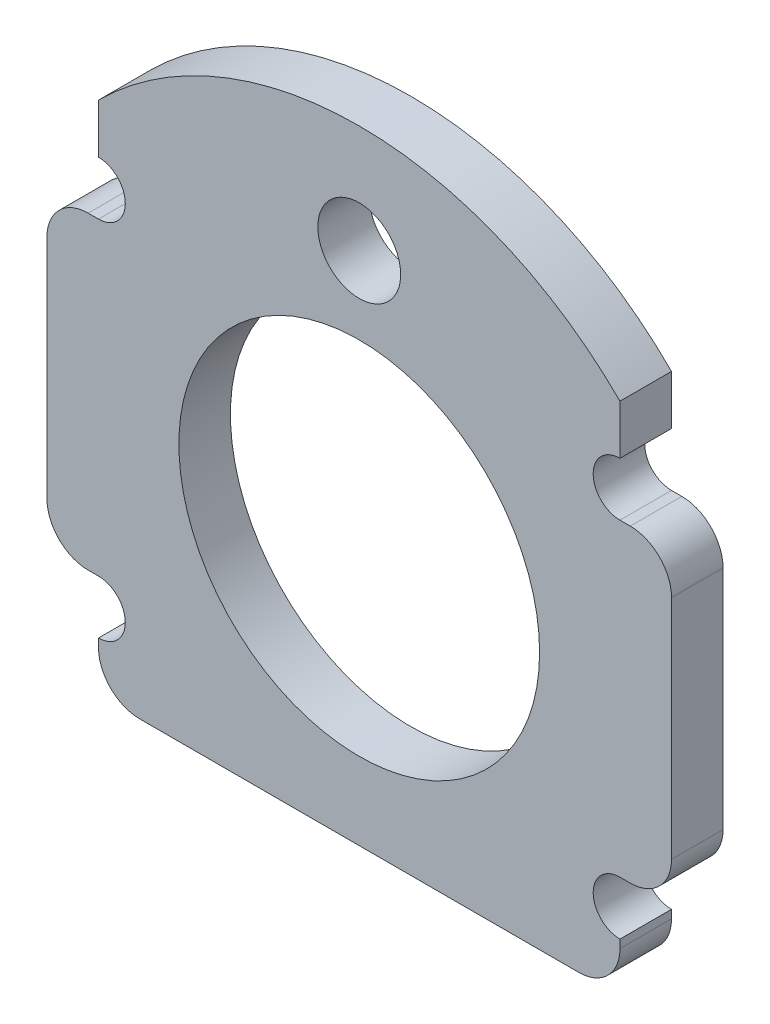
ISO-10303-21;
HEADER;
FILE_DESCRIPTION(('STEP AP214'),'2;1');
FILE_NAME('part.step','',(''),(''),'','','');
FILE_SCHEMA(('AUTOMOTIVE_DESIGN { 1 0 10303 214 1 1 1 1 }'));
ENDSEC;
DATA;
#1=APPLICATION_CONTEXT('core data for automotive mechanical design processes');
#2=APPLICATION_PROTOCOL_DEFINITION('international standard','automotive_design',2000,#1);
#3=PRODUCT_CONTEXT('',#1,'mechanical');
#4=PRODUCT('Part','Part','',(#3));
#5=PRODUCT_RELATED_PRODUCT_CATEGORY('part','',(#4));
#6=PRODUCT_DEFINITION_FORMATION('','',#4);
#7=PRODUCT_DEFINITION_CONTEXT('part definition',#1,'design');
#8=PRODUCT_DEFINITION('design','',#6,#7);
#9=PRODUCT_DEFINITION_SHAPE('','',#8);
#10=(LENGTH_UNIT() NAMED_UNIT(*) SI_UNIT(.MILLI.,.METRE.));
#11=(NAMED_UNIT(*) PLANE_ANGLE_UNIT() SI_UNIT($,.RADIAN.));
#12=(NAMED_UNIT(*) SI_UNIT($,.STERADIAN.) SOLID_ANGLE_UNIT());
#13=UNCERTAINTY_MEASURE_WITH_UNIT(LENGTH_MEASURE(1.E-05),#10,'distance_accuracy_value','');
#14=(GEOMETRIC_REPRESENTATION_CONTEXT(3) GLOBAL_UNCERTAINTY_ASSIGNED_CONTEXT((#13)) GLOBAL_UNIT_ASSIGNED_CONTEXT((#10,
#11,#12)) REPRESENTATION_CONTEXT('',''));
#15=CARTESIAN_POINT('',(0.,0.,0.));
#16=DIRECTION('',(0.,0.,1.));
#17=DIRECTION('',(1.,0.,0.));
#18=AXIS2_PLACEMENT_3D('',#15,#16,#17);
#19=CARTESIAN_POINT('',(0.,0.,3.175));
#20=DIRECTION('',(0.,0.,-1.));
#21=DIRECTION('',(-1.,0.,0.));
#22=AXIS2_PLACEMENT_3D('',#19,#20,#21);
#23=PLANE('',#22);
#24=CARTESIAN_POINT('',(0.,15.875,3.175));
#25=DIRECTION('',(0.,0.,-1.));
#26=DIRECTION('',(-1.,0.,0.));
#27=AXIS2_PLACEMENT_3D('',#24,#25,#26);
#28=CIRCLE('',#27,2.5527);
#29=CARTESIAN_POINT('',(-2.5527,15.875,3.175));
#30=VERTEX_POINT('',#29);
#31=EDGE_CURVE('E354',#30,#30,#28,.T.);
#32=ORIENTED_EDGE('',*,*,#31,.T.);
#33=EDGE_LOOP('',(#32));
#34=FACE_BOUND('',#33,.T.);
#35=DIRECTION('',(0.,1.,0.));
#36=VECTOR('',#35,1.);
#37=CARTESIAN_POINT('',(16.0655,-15.875,3.175));
#38=LINE('',#37,#36);
#39=CARTESIAN_POINT('',(16.0655,-13.335,3.175));
#40=VERTEX_POINT('',#39);
#41=CARTESIAN_POINT('',(16.0655,-12.827,3.175));
#42=VERTEX_POINT('',#41);
#43=EDGE_CURVE('E375',#40,#42,#38,.T.);
#44=ORIENTED_EDGE('',*,*,#43,.T.);
#45=CARTESIAN_POINT('',(16.0655,-11.176,3.175));
#46=DIRECTION('',(0.,0.,1.));
#47=DIRECTION('',(1.,0.,0.));
#48=AXIS2_PLACEMENT_3D('',#45,#46,#47);
#49=CIRCLE('',#48,1.651);
#50=CARTESIAN_POINT('',(16.0655,-9.525,3.175));
#51=VERTEX_POINT('',#50);
#52=EDGE_CURVE('E348',#51,#42,#49,.T.);
#53=ORIENTED_EDGE('',*,*,#52,.F.);
#54=DIRECTION('',(1.,0.,0.));
#55=VECTOR('',#54,1.);
#56=CARTESIAN_POINT('',(16.0655,-9.525,3.175));
#57=LINE('',#56,#55);
#58=CARTESIAN_POINT('',(16.7005,-9.525,3.175));
#59=VERTEX_POINT('',#58);
#60=EDGE_CURVE('E377',#51,#59,#57,.T.);
#61=ORIENTED_EDGE('',*,*,#60,.T.);
#62=CARTESIAN_POINT('',(16.7005,-6.985,3.175));
#63=DIRECTION('',(0.,0.,-1.));
#64=DIRECTION('',(-1.,0.,0.));
#65=AXIS2_PLACEMENT_3D('',#62,#63,#64);
#66=CIRCLE('',#65,2.54);
#67=CARTESIAN_POINT('',(19.2405,-6.985,3.175));
#68=VERTEX_POINT('',#67);
#69=EDGE_CURVE('E294',#59,#68,#66,.F.);
#70=ORIENTED_EDGE('',*,*,#69,.T.);
#71=DIRECTION('',(0.,1.,0.));
#72=VECTOR('',#71,1.);
#73=CARTESIAN_POINT('',(19.2405,-9.525,3.175));
#74=LINE('',#73,#72);
#75=CARTESIAN_POINT('',(19.2405,6.985,3.175));
#76=VERTEX_POINT('',#75);
#77=EDGE_CURVE('E215',#68,#76,#74,.T.);
#78=ORIENTED_EDGE('',*,*,#77,.T.);
#79=CARTESIAN_POINT('',(16.7005,6.985,3.175));
#80=DIRECTION('',(0.,0.,-1.));
#81=DIRECTION('',(-1.,0.,0.));
#82=AXIS2_PLACEMENT_3D('',#79,#80,#81);
#83=CIRCLE('',#82,2.54);
#84=CARTESIAN_POINT('',(16.7005,9.525,3.175));
#85=VERTEX_POINT('',#84);
#86=EDGE_CURVE('E296',#76,#85,#83,.F.);
#87=ORIENTED_EDGE('',*,*,#86,.T.);
#88=DIRECTION('',(-1.,0.,0.));
#89=VECTOR('',#88,1.);
#90=CARTESIAN_POINT('',(19.2405,9.525,3.175));
#91=LINE('',#90,#89);
#92=CARTESIAN_POINT('',(16.0655,9.525,3.175));
#93=VERTEX_POINT('',#92);
#94=EDGE_CURVE('E202',#85,#93,#91,.T.);
#95=ORIENTED_EDGE('',*,*,#94,.T.);
#96=CARTESIAN_POINT('',(16.0655,11.176,3.175));
#97=DIRECTION('',(0.,0.,1.));
#98=DIRECTION('',(-1.,0.,0.));
#99=AXIS2_PLACEMENT_3D('',#96,#97,#98);
#100=CIRCLE('',#99,1.651);
#101=CARTESIAN_POINT('',(16.0655,12.827,3.175));
#102=VERTEX_POINT('',#101);
#103=EDGE_CURVE('E189',#102,#93,#100,.T.);
#104=ORIENTED_EDGE('',*,*,#103,.F.);
#105=DIRECTION('',(0.,1.,0.));
#106=VECTOR('',#105,1.);
#107=CARTESIAN_POINT('',(16.0655,9.525,3.175));
#108=LINE('',#107,#106);
#109=CARTESIAN_POINT('',(16.0655,15.875,3.175));
#110=VERTEX_POINT('',#109);
#111=EDGE_CURVE('E199',#102,#110,#108,.T.);
#112=ORIENTED_EDGE('',*,*,#111,.T.);
#113=CARTESIAN_POINT('',(0.,-0.19050000000026,3.175));
#114=DIRECTION('',(0.,0.,1.));
#115=DIRECTION('',(-1.,0.,0.));
#116=AXIS2_PLACEMENT_3D('',#113,#114,#115);
#117=CIRCLE('',#116,22.7200479863051);
#118=CARTESIAN_POINT('',(-16.0655,15.875,3.175));
#119=VERTEX_POINT('',#118);
#120=EDGE_CURVE('E357',#110,#119,#117,.T.);
#121=ORIENTED_EDGE('',*,*,#120,.T.);
#122=DIRECTION('',(0.,-1.,0.));
#123=VECTOR('',#122,1.);
#124=CARTESIAN_POINT('',(-16.0655,15.875,3.175));
#125=LINE('',#124,#123);
#126=CARTESIAN_POINT('',(-16.0655,12.827,3.175));
#127=VERTEX_POINT('',#126);
#128=EDGE_CURVE('E210',#119,#127,#125,.T.);
#129=ORIENTED_EDGE('',*,*,#128,.T.);
#130=CARTESIAN_POINT('',(-16.0655,11.176,3.175));
#131=DIRECTION('',(0.,0.,1.));
#132=DIRECTION('',(1.,0.,0.));
#133=AXIS2_PLACEMENT_3D('',#130,#131,#132);
#134=CIRCLE('',#133,1.651);
#135=CARTESIAN_POINT('',(-16.0655,9.525,3.175));
#136=VERTEX_POINT('',#135);
#137=EDGE_CURVE('E400',#136,#127,#134,.T.);
#138=ORIENTED_EDGE('',*,*,#137,.F.);
#139=DIRECTION('',(-1.,0.,0.));
#140=VECTOR('',#139,1.);
#141=CARTESIAN_POINT('',(-16.0655,9.525,3.175));
#142=LINE('',#141,#140);
#143=CARTESIAN_POINT('',(-16.7005,9.525,3.175));
#144=VERTEX_POINT('',#143);
#145=EDGE_CURVE('E251',#136,#144,#142,.T.);
#146=ORIENTED_EDGE('',*,*,#145,.T.);
#147=CARTESIAN_POINT('',(-16.7005,6.985,3.175));
#148=DIRECTION('',(0.,0.,-1.));
#149=DIRECTION('',(-1.,0.,0.));
#150=AXIS2_PLACEMENT_3D('',#147,#148,#149);
#151=CIRCLE('',#150,2.54);
#152=CARTESIAN_POINT('',(-19.2405,6.985,3.175));
#153=VERTEX_POINT('',#152);
#154=EDGE_CURVE('E286',#144,#153,#151,.F.);
#155=ORIENTED_EDGE('',*,*,#154,.T.);
#156=DIRECTION('',(0.,-1.,0.));
#157=VECTOR('',#156,1.);
#158=CARTESIAN_POINT('',(-19.2405,-9.525,3.175));
#159=LINE('',#158,#157);
#160=CARTESIAN_POINT('',(-19.2405,-6.985,3.175));
#161=VERTEX_POINT('',#160);
#162=EDGE_CURVE('E321',#153,#161,#159,.T.);
#163=ORIENTED_EDGE('',*,*,#162,.T.);
#164=CARTESIAN_POINT('',(-16.7005,-6.985,3.175));
#165=DIRECTION('',(0.,0.,-1.));
#166=DIRECTION('',(-1.,0.,0.));
#167=AXIS2_PLACEMENT_3D('',#164,#165,#166);
#168=CIRCLE('',#167,2.54);
#169=CARTESIAN_POINT('',(-16.7005,-9.525,3.175));
#170=VERTEX_POINT('',#169);
#171=EDGE_CURVE('E288',#161,#170,#168,.F.);
#172=ORIENTED_EDGE('',*,*,#171,.T.);
#173=DIRECTION('',(1.,0.,0.));
#174=VECTOR('',#173,1.);
#175=CARTESIAN_POINT('',(-19.2405,-9.525,3.175));
#176=LINE('',#175,#174);
#177=CARTESIAN_POINT('',(-16.0655,-9.525,3.175));
#178=VERTEX_POINT('',#177);
#179=EDGE_CURVE('E330',#170,#178,#176,.T.);
#180=ORIENTED_EDGE('',*,*,#179,.T.);
#181=CARTESIAN_POINT('',(-16.0655,-11.176,3.175));
#182=DIRECTION('',(0.,0.,1.));
#183=DIRECTION('',(-1.,0.,0.));
#184=AXIS2_PLACEMENT_3D('',#181,#182,#183);
#185=CIRCLE('',#184,1.651);
#186=CARTESIAN_POINT('',(-16.0655,-12.827,3.175));
#187=VERTEX_POINT('',#186);
#188=EDGE_CURVE('E344',#187,#178,#185,.T.);
#189=ORIENTED_EDGE('',*,*,#188,.F.);
#190=DIRECTION('',(0.,-1.,0.));
#191=VECTOR('',#190,1.);
#192=CARTESIAN_POINT('',(-16.0655,-9.525,3.175));
#193=LINE('',#192,#191);
#194=CARTESIAN_POINT('',(-16.0655,-13.335,3.175));
#195=VERTEX_POINT('',#194);
#196=EDGE_CURVE('E370',#187,#195,#193,.T.);
#197=ORIENTED_EDGE('',*,*,#196,.T.);
#198=CARTESIAN_POINT('',(-13.5255,-13.335,3.175));
#199=DIRECTION('',(0.,0.,-1.));
#200=DIRECTION('',(-1.,0.,0.));
#201=AXIS2_PLACEMENT_3D('',#198,#199,#200);
#202=CIRCLE('',#201,2.54);
#203=CARTESIAN_POINT('',(-13.5255,-15.875,3.175));
#204=VERTEX_POINT('',#203);
#205=EDGE_CURVE('E290',#195,#204,#202,.F.);
#206=ORIENTED_EDGE('',*,*,#205,.T.);
#207=DIRECTION('',(1.,0.,0.));
#208=VECTOR('',#207,1.);
#209=CARTESIAN_POINT('',(-16.0655,-15.875,3.175));
#210=LINE('',#209,#208);
#211=CARTESIAN_POINT('',(13.5255,-15.875,3.175));
#212=VERTEX_POINT('',#211);
#213=EDGE_CURVE('E372',#204,#212,#210,.T.);
#214=ORIENTED_EDGE('',*,*,#213,.T.);
#215=CARTESIAN_POINT('',(13.5255,-13.335,3.175));
#216=DIRECTION('',(0.,0.,-1.));
#217=DIRECTION('',(-1.,0.,0.));
#218=AXIS2_PLACEMENT_3D('',#215,#216,#217);
#219=CIRCLE('',#218,2.54);
#220=EDGE_CURVE('E292',#212,#40,#219,.F.);
#221=ORIENTED_EDGE('',*,*,#220,.T.);
#222=EDGE_LOOP('',(#44,#53,#61,#70,#78,#87,#95,#104,#112,#121,#129,#138,#146,#155,#163,#172,
#180,#189,#197,#206,#214,#221));
#223=FACE_BOUND('',#222,.T.);
#224=CARTESIAN_POINT('',(0.,0.,3.175));
#225=DIRECTION('',(0.,0.,1.));
#226=DIRECTION('',(1.,0.,0.));
#227=AXIS2_PLACEMENT_3D('',#224,#225,#226);
#228=CIRCLE('',#227,11.1125);
#229=CARTESIAN_POINT('',(11.1125,0.,3.175));
#230=VERTEX_POINT('',#229);
#231=EDGE_CURVE('E223',#230,#230,#228,.T.);
#232=ORIENTED_EDGE('',*,*,#231,.F.);
#233=EDGE_LOOP('',(#232));
#234=FACE_BOUND('',#233,.T.);
#235=ADVANCED_FACE('F41',(#34,#223,#234),#23,.F.);
#236=CARTESIAN_POINT('',(0.,0.,0.));
#237=DIRECTION('',(0.,0.,-1.));
#238=DIRECTION('',(-1.,0.,0.));
#239=AXIS2_PLACEMENT_3D('',#236,#237,#238);
#240=PLANE('',#239);
#241=CARTESIAN_POINT('',(16.0655,-11.176,0.));
#242=DIRECTION('',(0.,0.,1.));
#243=DIRECTION('',(1.,0.,0.));
#244=AXIS2_PLACEMENT_3D('',#241,#242,#243);
#245=CIRCLE('',#244,1.651);
#246=CARTESIAN_POINT('',(16.0655,-9.525,0.));
#247=VERTEX_POINT('',#246);
#248=CARTESIAN_POINT('',(16.0655,-12.827,0.));
#249=VERTEX_POINT('',#248);
#250=EDGE_CURVE('E399',#247,#249,#245,.T.);
#251=ORIENTED_EDGE('',*,*,#250,.T.);
#252=DIRECTION('',(0.,1.,0.));
#253=VECTOR('',#252,1.);
#254=CARTESIAN_POINT('',(16.0655,-15.875,0.));
#255=LINE('',#254,#253);
#256=CARTESIAN_POINT('',(16.0655,-13.335,0.));
#257=VERTEX_POINT('',#256);
#258=EDGE_CURVE('E234',#257,#249,#255,.T.);
#259=ORIENTED_EDGE('',*,*,#258,.F.);
#260=CARTESIAN_POINT('',(13.5255,-13.335,0.));
#261=DIRECTION('',(0.,0.,-1.));
#262=DIRECTION('',(-1.,0.,0.));
#263=AXIS2_PLACEMENT_3D('',#260,#261,#262);
#264=CIRCLE('',#263,2.54);
#265=CARTESIAN_POINT('',(13.5255,-15.875,0.));
#266=VERTEX_POINT('',#265);
#267=EDGE_CURVE('E275',#257,#266,#264,.T.);
#268=ORIENTED_EDGE('',*,*,#267,.T.);
#269=DIRECTION('',(1.,0.,0.));
#270=VECTOR('',#269,1.);
#271=CARTESIAN_POINT('',(-16.0655,-15.875,0.));
#272=LINE('',#271,#270);
#273=CARTESIAN_POINT('',(-13.5255,-15.875,0.));
#274=VERTEX_POINT('',#273);
#275=EDGE_CURVE('E231',#274,#266,#272,.T.);
#276=ORIENTED_EDGE('',*,*,#275,.F.);
#277=CARTESIAN_POINT('',(-13.5255,-13.335,0.));
#278=DIRECTION('',(0.,0.,-1.));
#279=DIRECTION('',(-1.,0.,0.));
#280=AXIS2_PLACEMENT_3D('',#277,#278,#279);
#281=CIRCLE('',#280,2.54);
#282=CARTESIAN_POINT('',(-16.0655,-13.335,0.));
#283=VERTEX_POINT('',#282);
#284=EDGE_CURVE('E272',#274,#283,#281,.T.);
#285=ORIENTED_EDGE('',*,*,#284,.T.);
#286=DIRECTION('',(0.,-1.,0.));
#287=VECTOR('',#286,1.);
#288=CARTESIAN_POINT('',(-16.0655,-9.525,0.));
#289=LINE('',#288,#287);
#290=CARTESIAN_POINT('',(-16.0655,-12.827,0.));
#291=VERTEX_POINT('',#290);
#292=EDGE_CURVE('E229',#291,#283,#289,.T.);
#293=ORIENTED_EDGE('',*,*,#292,.F.);
#294=CARTESIAN_POINT('',(-16.0655,-11.176,0.));
#295=DIRECTION('',(0.,0.,1.));
#296=DIRECTION('',(-1.,0.,0.));
#297=AXIS2_PLACEMENT_3D('',#294,#295,#296);
#298=CIRCLE('',#297,1.651);
#299=CARTESIAN_POINT('',(-16.0655,-9.525,0.));
#300=VERTEX_POINT('',#299);
#301=EDGE_CURVE('E56',#291,#300,#298,.T.);
#302=ORIENTED_EDGE('',*,*,#301,.T.);
#303=DIRECTION('',(1.,0.,0.));
#304=VECTOR('',#303,1.);
#305=CARTESIAN_POINT('',(-19.2405,-9.525,0.));
#306=LINE('',#305,#304);
#307=CARTESIAN_POINT('',(-16.7005,-9.525,0.));
#308=VERTEX_POINT('',#307);
#309=EDGE_CURVE('E226',#308,#300,#306,.T.);
#310=ORIENTED_EDGE('',*,*,#309,.F.);
#311=CARTESIAN_POINT('',(-16.7005,-6.985,0.));
#312=DIRECTION('',(0.,0.,-1.));
#313=DIRECTION('',(-1.,0.,0.));
#314=AXIS2_PLACEMENT_3D('',#311,#312,#313);
#315=CIRCLE('',#314,2.54);
#316=CARTESIAN_POINT('',(-19.2405,-6.985,0.));
#317=VERTEX_POINT('',#316);
#318=EDGE_CURVE('E270',#308,#317,#315,.T.);
#319=ORIENTED_EDGE('',*,*,#318,.T.);
#320=DIRECTION('',(0.,-1.,0.));
#321=VECTOR('',#320,1.);
#322=CARTESIAN_POINT('',(-19.2405,-9.525,0.));
#323=LINE('',#322,#321);
#324=CARTESIAN_POINT('',(-19.2405,6.985,0.));
#325=VERTEX_POINT('',#324);
#326=EDGE_CURVE('E222',#325,#317,#323,.T.);
#327=ORIENTED_EDGE('',*,*,#326,.F.);
#328=CARTESIAN_POINT('',(-16.7005,6.985,0.));
#329=DIRECTION('',(0.,0.,-1.));
#330=DIRECTION('',(-1.,0.,0.));
#331=AXIS2_PLACEMENT_3D('',#328,#329,#330);
#332=CIRCLE('',#331,2.54);
#333=CARTESIAN_POINT('',(-16.7005,9.525,0.));
#334=VERTEX_POINT('',#333);
#335=EDGE_CURVE('E268',#325,#334,#332,.T.);
#336=ORIENTED_EDGE('',*,*,#335,.T.);
#337=DIRECTION('',(-1.,0.,0.));
#338=VECTOR('',#337,1.);
#339=CARTESIAN_POINT('',(-16.0655,9.525,0.));
#340=LINE('',#339,#338);
#341=CARTESIAN_POINT('',(-16.0655,9.525,0.));
#342=VERTEX_POINT('',#341);
#343=EDGE_CURVE('E219',#342,#334,#340,.T.);
#344=ORIENTED_EDGE('',*,*,#343,.F.);
#345=CARTESIAN_POINT('',(-16.0655,11.176,0.));
#346=DIRECTION('',(0.,0.,1.));
#347=DIRECTION('',(1.,0.,0.));
#348=AXIS2_PLACEMENT_3D('',#345,#346,#347);
#349=CIRCLE('',#348,1.651);
#350=CARTESIAN_POINT('',(-16.0655,12.827,0.));
#351=VERTEX_POINT('',#350);
#352=EDGE_CURVE('E351',#342,#351,#349,.T.);
#353=ORIENTED_EDGE('',*,*,#352,.T.);
#354=DIRECTION('',(0.,-1.,0.));
#355=VECTOR('',#354,1.);
#356=CARTESIAN_POINT('',(-16.0655,15.875,0.));
#357=LINE('',#356,#355);
#358=CARTESIAN_POINT('',(-16.0655,15.875,0.));
#359=VERTEX_POINT('',#358);
#360=EDGE_CURVE('E248',#359,#351,#357,.T.);
#361=ORIENTED_EDGE('',*,*,#360,.F.);
#362=CARTESIAN_POINT('',(0.,-0.19050000000026,0.));
#363=DIRECTION('',(0.,0.,1.));
#364=DIRECTION('',(-1.,0.,0.));
#365=AXIS2_PLACEMENT_3D('',#362,#363,#364);
#366=CIRCLE('',#365,22.7200479863051);
#367=CARTESIAN_POINT('',(16.0655,15.875,0.));
#368=VERTEX_POINT('',#367);
#369=EDGE_CURVE('E360',#368,#359,#366,.T.);
#370=ORIENTED_EDGE('',*,*,#369,.F.);
#371=DIRECTION('',(0.,1.,0.));
#372=VECTOR('',#371,1.);
#373=CARTESIAN_POINT('',(16.0655,9.525,0.));
#374=LINE('',#373,#372);
#375=CARTESIAN_POINT('',(16.0655,12.827,0.));
#376=VERTEX_POINT('',#375);
#377=EDGE_CURVE('E246',#376,#368,#374,.T.);
#378=ORIENTED_EDGE('',*,*,#377,.F.);
#379=CARTESIAN_POINT('',(16.0655,11.176,0.));
#380=DIRECTION('',(0.,0.,1.));
#381=DIRECTION('',(-1.,0.,0.));
#382=AXIS2_PLACEMENT_3D('',#379,#380,#381);
#383=CIRCLE('',#382,1.651);
#384=CARTESIAN_POINT('',(16.0655,9.525,0.));
#385=VERTEX_POINT('',#384);
#386=EDGE_CURVE('E64',#376,#385,#383,.T.);
#387=ORIENTED_EDGE('',*,*,#386,.T.);
#388=DIRECTION('',(-1.,0.,0.));
#389=VECTOR('',#388,1.);
#390=CARTESIAN_POINT('',(19.2405,9.525,0.));
#391=LINE('',#390,#389);
#392=CARTESIAN_POINT('',(16.7005,9.525,0.));
#393=VERTEX_POINT('',#392);
#394=EDGE_CURVE('E243',#393,#385,#391,.T.);
#395=ORIENTED_EDGE('',*,*,#394,.F.);
#396=CARTESIAN_POINT('',(16.7005,6.985,0.));
#397=DIRECTION('',(0.,0.,-1.));
#398=DIRECTION('',(-1.,0.,0.));
#399=AXIS2_PLACEMENT_3D('',#396,#397,#398);
#400=CIRCLE('',#399,2.54);
#401=CARTESIAN_POINT('',(19.2405,6.985,0.));
#402=VERTEX_POINT('',#401);
#403=EDGE_CURVE('E279',#393,#402,#400,.T.);
#404=ORIENTED_EDGE('',*,*,#403,.T.);
#405=DIRECTION('',(0.,1.,0.));
#406=VECTOR('',#405,1.);
#407=CARTESIAN_POINT('',(19.2405,-9.525,0.));
#408=LINE('',#407,#406);
#409=CARTESIAN_POINT('',(19.2405,-6.985,0.));
#410=VERTEX_POINT('',#409);
#411=EDGE_CURVE('E240',#410,#402,#408,.T.);
#412=ORIENTED_EDGE('',*,*,#411,.F.);
#413=CARTESIAN_POINT('',(16.7005,-6.985,0.));
#414=DIRECTION('',(0.,0.,-1.));
#415=DIRECTION('',(-1.,0.,0.));
#416=AXIS2_PLACEMENT_3D('',#413,#414,#415);
#417=CIRCLE('',#416,2.54);
#418=CARTESIAN_POINT('',(16.7005,-9.525,0.));
#419=VERTEX_POINT('',#418);
#420=EDGE_CURVE('E277',#410,#419,#417,.T.);
#421=ORIENTED_EDGE('',*,*,#420,.T.);
#422=DIRECTION('',(1.,0.,0.));
#423=VECTOR('',#422,1.);
#424=CARTESIAN_POINT('',(16.0655,-9.525,0.));
#425=LINE('',#424,#423);
#426=EDGE_CURVE('E237',#247,#419,#425,.T.);
#427=ORIENTED_EDGE('',*,*,#426,.F.);
#428=EDGE_LOOP('',(#251,#259,#268,#276,#285,#293,#302,#310,#319,#327,#336,#344,#353,#361,#370,
#378,#387,#395,#404,#412,#421,#427));
#429=FACE_BOUND('',#428,.T.);
#430=CARTESIAN_POINT('',(0.,15.875,0.));
#431=DIRECTION('',(0.,0.,-1.));
#432=DIRECTION('',(-1.,0.,0.));
#433=AXIS2_PLACEMENT_3D('',#430,#431,#432);
#434=CIRCLE('',#433,2.5527);
#435=CARTESIAN_POINT('',(-2.5527,15.875,0.));
#436=VERTEX_POINT('',#435);
#437=EDGE_CURVE('E346',#436,#436,#434,.T.);
#438=ORIENTED_EDGE('',*,*,#437,.F.);
#439=EDGE_LOOP('',(#438));
#440=FACE_BOUND('',#439,.T.);
#441=CARTESIAN_POINT('',(0.,0.,0.));
#442=DIRECTION('',(0.,0.,1.));
#443=DIRECTION('',(1.,0.,0.));
#444=AXIS2_PLACEMENT_3D('',#441,#442,#443);
#445=CIRCLE('',#444,11.1125);
#446=CARTESIAN_POINT('',(11.1125,0.,0.));
#447=VERTEX_POINT('',#446);
#448=EDGE_CURVE('E362',#447,#447,#445,.T.);
#449=ORIENTED_EDGE('',*,*,#448,.T.);
#450=EDGE_LOOP('',(#449));
#451=FACE_BOUND('',#450,.T.);
#452=ADVANCED_FACE('F340',(#429,#440,#451),#240,.T.);
#453=CARTESIAN_POINT('',(-16.0655,9.525,3.175));
#454=DIRECTION('',(0.,-1.,0.));
#455=DIRECTION('',(0.,0.,-1.));
#456=AXIS2_PLACEMENT_3D('',#453,#454,#455);
#457=PLANE('',#456);
#458=ORIENTED_EDGE('',*,*,#343,.T.);
#459=DIRECTION('',(0.,0.,-1.));
#460=VECTOR('',#459,1.);
#461=CARTESIAN_POINT('',(-16.7005,9.525,3.175));
#462=LINE('',#461,#460);
#463=EDGE_CURVE('E11',#334,#144,#462,.F.);
#464=ORIENTED_EDGE('',*,*,#463,.T.);
#465=ORIENTED_EDGE('',*,*,#145,.F.);
#466=DIRECTION('',(0.,0.,-1.));
#467=VECTOR('',#466,1.);
#468=CARTESIAN_POINT('',(-16.0655,9.525,3.175));
#469=LINE('',#468,#467);
#470=EDGE_CURVE('E213',#136,#342,#469,.T.);
#471=ORIENTED_EDGE('',*,*,#470,.T.);
#472=EDGE_LOOP('',(#458,#464,#465,#471));
#473=FACE_BOUND('',#472,.T.);
#474=ADVANCED_FACE('F416',(#473),#457,.F.);
#475=CARTESIAN_POINT('',(-19.2405,-9.525,3.175));
#476=DIRECTION('',(1.,0.,0.));
#477=DIRECTION('',(0.,0.,-1.));
#478=AXIS2_PLACEMENT_3D('',#475,#476,#477);
#479=PLANE('',#478);
#480=ORIENTED_EDGE('',*,*,#326,.T.);
#481=DIRECTION('',(0.,0.,-1.));
#482=VECTOR('',#481,1.);
#483=CARTESIAN_POINT('',(-19.2405,-6.985,3.175));
#484=LINE('',#483,#482);
#485=EDGE_CURVE('E49',#317,#161,#484,.F.);
#486=ORIENTED_EDGE('',*,*,#485,.T.);
#487=ORIENTED_EDGE('',*,*,#162,.F.);
#488=DIRECTION('',(0.,0.,-1.));
#489=VECTOR('',#488,1.);
#490=CARTESIAN_POINT('',(-19.2405,6.985,3.175));
#491=LINE('',#490,#489);
#492=EDGE_CURVE('E314',#153,#325,#491,.T.);
#493=ORIENTED_EDGE('',*,*,#492,.T.);
#494=EDGE_LOOP('',(#480,#486,#487,#493));
#495=FACE_BOUND('',#494,.T.);
#496=ADVANCED_FACE('F320',(#495),#479,.F.);
#497=CARTESIAN_POINT('',(-19.2405,-9.525,3.175));
#498=DIRECTION('',(0.,1.,0.));
#499=DIRECTION('',(0.,0.,1.));
#500=AXIS2_PLACEMENT_3D('',#497,#498,#499);
#501=PLANE('',#500);
#502=ORIENTED_EDGE('',*,*,#179,.F.);
#503=DIRECTION('',(0.,0.,-1.));
#504=VECTOR('',#503,1.);
#505=CARTESIAN_POINT('',(-16.7005,-9.525,3.175));
#506=LINE('',#505,#504);
#507=EDGE_CURVE('E311',#170,#308,#506,.T.);
#508=ORIENTED_EDGE('',*,*,#507,.T.);
#509=ORIENTED_EDGE('',*,*,#309,.T.);
#510=DIRECTION('',(0.,0.,-1.));
#511=VECTOR('',#510,1.);
#512=CARTESIAN_POINT('',(-16.0655,-9.525,3.175));
#513=LINE('',#512,#511);
#514=EDGE_CURVE('E263',#178,#300,#513,.T.);
#515=ORIENTED_EDGE('',*,*,#514,.F.);
#516=EDGE_LOOP('',(#502,#508,#509,#515));
#517=FACE_BOUND('',#516,.T.);
#518=ADVANCED_FACE('F336',(#517),#501,.F.);
#519=CARTESIAN_POINT('',(-16.0655,-9.525,3.175));
#520=DIRECTION('',(1.,0.,0.));
#521=DIRECTION('',(0.,0.,-1.));
#522=AXIS2_PLACEMENT_3D('',#519,#520,#521);
#523=PLANE('',#522);
#524=ORIENTED_EDGE('',*,*,#196,.F.);
#525=DIRECTION('',(0.,0.,1.));
#526=VECTOR('',#525,1.);
#527=CARTESIAN_POINT('',(-16.0655,-12.827,0.));
#528=LINE('',#527,#526);
#529=EDGE_CURVE('E343',#291,#187,#528,.T.);
#530=ORIENTED_EDGE('',*,*,#529,.F.);
#531=ORIENTED_EDGE('',*,*,#292,.T.);
#532=DIRECTION('',(0.,0.,-1.));
#533=VECTOR('',#532,1.);
#534=CARTESIAN_POINT('',(-16.0655,-13.335,3.175));
#535=LINE('',#534,#533);
#536=EDGE_CURVE('E308',#283,#195,#535,.F.);
#537=ORIENTED_EDGE('',*,*,#536,.T.);
#538=EDGE_LOOP('',(#524,#530,#531,#537));
#539=FACE_BOUND('',#538,.T.);
#540=ADVANCED_FACE('F458',(#539),#523,.F.);
#541=CARTESIAN_POINT('',(-16.0655,-15.875,3.175));
#542=DIRECTION('',(0.,1.,0.));
#543=DIRECTION('',(-1.,0.,0.));
#544=AXIS2_PLACEMENT_3D('',#541,#542,#543);
#545=PLANE('',#544);
#546=ORIENTED_EDGE('',*,*,#275,.T.);
#547=DIRECTION('',(0.,0.,-1.));
#548=VECTOR('',#547,1.);
#549=CARTESIAN_POINT('',(13.5255,-15.875,3.175));
#550=LINE('',#549,#548);
#551=EDGE_CURVE('E306',#266,#212,#550,.F.);
#552=ORIENTED_EDGE('',*,*,#551,.T.);
#553=ORIENTED_EDGE('',*,*,#213,.F.);
#554=DIRECTION('',(0.,0.,-1.));
#555=VECTOR('',#554,1.);
#556=CARTESIAN_POINT('',(-13.5255,-15.875,3.175));
#557=LINE('',#556,#555);
#558=EDGE_CURVE('E303',#204,#274,#557,.T.);
#559=ORIENTED_EDGE('',*,*,#558,.T.);
#560=EDGE_LOOP('',(#546,#552,#553,#559));
#561=FACE_BOUND('',#560,.T.);
#562=ADVANCED_FACE('F454',(#561),#545,.F.);
#563=CARTESIAN_POINT('',(16.0655,-15.875,3.175));
#564=DIRECTION('',(-1.,0.,0.));
#565=DIRECTION('',(0.,-1.,0.));
#566=AXIS2_PLACEMENT_3D('',#563,#564,#565);
#567=PLANE('',#566);
#568=ORIENTED_EDGE('',*,*,#258,.T.);
#569=DIRECTION('',(0.,0.,1.));
#570=VECTOR('',#569,1.);
#571=CARTESIAN_POINT('',(16.0655,-12.827,0.));
#572=LINE('',#571,#570);
#573=EDGE_CURVE('E396',#249,#42,#572,.T.);
#574=ORIENTED_EDGE('',*,*,#573,.T.);
#575=ORIENTED_EDGE('',*,*,#43,.F.);
#576=DIRECTION('',(0.,0.,-1.));
#577=VECTOR('',#576,1.);
#578=CARTESIAN_POINT('',(16.0655,-13.335,3.175));
#579=LINE('',#578,#577);
#580=EDGE_CURVE('E300',#40,#257,#579,.T.);
#581=ORIENTED_EDGE('',*,*,#580,.T.);
#582=EDGE_LOOP('',(#568,#574,#575,#581));
#583=FACE_BOUND('',#582,.T.);
#584=ADVANCED_FACE('F450',(#583),#567,.F.);
#585=CARTESIAN_POINT('',(16.0655,-9.525,3.175));
#586=DIRECTION('',(0.,1.,0.));
#587=DIRECTION('',(-1.,0.,0.));
#588=AXIS2_PLACEMENT_3D('',#585,#586,#587);
#589=PLANE('',#588);
#590=ORIENTED_EDGE('',*,*,#426,.T.);
#591=DIRECTION('',(0.,0.,-1.));
#592=VECTOR('',#591,1.);
#593=CARTESIAN_POINT('',(16.7005,-9.525,3.175));
#594=LINE('',#593,#592);
#595=EDGE_CURVE('E298',#419,#59,#594,.F.);
#596=ORIENTED_EDGE('',*,*,#595,.T.);
#597=ORIENTED_EDGE('',*,*,#60,.F.);
#598=DIRECTION('',(0.,0.,-1.));
#599=VECTOR('',#598,1.);
#600=CARTESIAN_POINT('',(16.0655,-9.525,3.175));
#601=LINE('',#600,#599);
#602=EDGE_CURVE('E260',#51,#247,#601,.T.);
#603=ORIENTED_EDGE('',*,*,#602,.T.);
#604=EDGE_LOOP('',(#590,#596,#597,#603));
#605=FACE_BOUND('',#604,.T.);
#606=ADVANCED_FACE('F447',(#605),#589,.F.);
#607=CARTESIAN_POINT('',(19.2405,-9.525,3.175));
#608=DIRECTION('',(-1.,0.,0.));
#609=DIRECTION('',(0.,0.,1.));
#610=AXIS2_PLACEMENT_3D('',#607,#608,#609);
#611=PLANE('',#610);
#612=ORIENTED_EDGE('',*,*,#411,.T.);
#613=DIRECTION('',(0.,0.,-1.));
#614=VECTOR('',#613,1.);
#615=CARTESIAN_POINT('',(19.2405,6.985,3.175));
#616=LINE('',#615,#614);
#617=EDGE_CURVE('E284',#402,#76,#616,.F.);
#618=ORIENTED_EDGE('',*,*,#617,.T.);
#619=ORIENTED_EDGE('',*,*,#77,.F.);
#620=DIRECTION('',(0.,0.,-1.));
#621=VECTOR('',#620,1.);
#622=CARTESIAN_POINT('',(19.2405,-6.985,3.175));
#623=LINE('',#622,#621);
#624=EDGE_CURVE('E281',#68,#410,#623,.T.);
#625=ORIENTED_EDGE('',*,*,#624,.T.);
#626=EDGE_LOOP('',(#612,#618,#619,#625));
#627=FACE_BOUND('',#626,.T.);
#628=ADVANCED_FACE('F444',(#627),#611,.F.);
#629=CARTESIAN_POINT('',(19.2405,9.525,3.175));
#630=DIRECTION('',(0.,-1.,0.));
#631=DIRECTION('',(0.,0.,-1.));
#632=AXIS2_PLACEMENT_3D('',#629,#630,#631);
#633=PLANE('',#632);
#634=ORIENTED_EDGE('',*,*,#94,.F.);
#635=DIRECTION('',(0.,0.,-1.));
#636=VECTOR('',#635,1.);
#637=CARTESIAN_POINT('',(16.7005,9.525,3.175));
#638=LINE('',#637,#636);
#639=EDGE_CURVE('E265',#85,#393,#638,.T.);
#640=ORIENTED_EDGE('',*,*,#639,.T.);
#641=ORIENTED_EDGE('',*,*,#394,.T.);
#642=DIRECTION('',(0.,0.,-1.));
#643=VECTOR('',#642,1.);
#644=CARTESIAN_POINT('',(16.0655,9.525,3.175));
#645=LINE('',#644,#643);
#646=EDGE_CURVE('E258',#93,#385,#645,.T.);
#647=ORIENTED_EDGE('',*,*,#646,.F.);
#648=EDGE_LOOP('',(#634,#640,#641,#647));
#649=FACE_BOUND('',#648,.T.);
#650=ADVANCED_FACE('F391',(#649),#633,.F.);
#651=CARTESIAN_POINT('',(16.0655,9.525,3.175));
#652=DIRECTION('',(-1.,0.,0.));
#653=DIRECTION('',(0.,0.,1.));
#654=AXIS2_PLACEMENT_3D('',#651,#652,#653);
#655=PLANE('',#654);
#656=ORIENTED_EDGE('',*,*,#111,.F.);
#657=DIRECTION('',(0.,0.,1.));
#658=VECTOR('',#657,1.);
#659=CARTESIAN_POINT('',(16.0655,12.827,0.));
#660=LINE('',#659,#658);
#661=EDGE_CURVE('E186',#376,#102,#660,.T.);
#662=ORIENTED_EDGE('',*,*,#661,.F.);
#663=ORIENTED_EDGE('',*,*,#377,.T.);
#664=DIRECTION('',(0.,0.,-1.));
#665=VECTOR('',#664,1.);
#666=CARTESIAN_POINT('',(16.0655,15.875,3.175));
#667=LINE('',#666,#665);
#668=EDGE_CURVE('E209',#110,#368,#667,.T.);
#669=ORIENTED_EDGE('',*,*,#668,.F.);
#670=EDGE_LOOP('',(#656,#662,#663,#669));
#671=FACE_BOUND('',#670,.T.);
#672=ADVANCED_FACE('F207',(#671),#655,.F.);
#673=CARTESIAN_POINT('',(-16.0655,15.875,3.175));
#674=DIRECTION('',(1.,0.,0.));
#675=DIRECTION('',(0.,0.,-1.));
#676=AXIS2_PLACEMENT_3D('',#673,#674,#675);
#677=PLANE('',#676);
#678=ORIENTED_EDGE('',*,*,#360,.T.);
#679=DIRECTION('',(0.,0.,1.));
#680=VECTOR('',#679,1.);
#681=CARTESIAN_POINT('',(-16.0655,12.827,0.));
#682=LINE('',#681,#680);
#683=EDGE_CURVE('E204',#351,#127,#682,.T.);
#684=ORIENTED_EDGE('',*,*,#683,.T.);
#685=ORIENTED_EDGE('',*,*,#128,.F.);
#686=DIRECTION('',(0.,0.,-1.));
#687=VECTOR('',#686,1.);
#688=CARTESIAN_POINT('',(-16.0655,15.875,3.175));
#689=LINE('',#688,#687);
#690=EDGE_CURVE('E254',#119,#359,#689,.T.);
#691=ORIENTED_EDGE('',*,*,#690,.T.);
#692=EDGE_LOOP('',(#678,#684,#685,#691));
#693=FACE_BOUND('',#692,.T.);
#694=ADVANCED_FACE('F410',(#693),#677,.F.);
#695=CARTESIAN_POINT('',(0.,0.,3.175));
#696=DIRECTION('',(0.,0.,-1.));
#697=DIRECTION('',(-1.,0.,0.));
#698=AXIS2_PLACEMENT_3D('',#695,#696,#697);
#699=CYLINDRICAL_SURFACE('',#698,11.1125);
#700=ORIENTED_EDGE('',*,*,#231,.T.);
#701=EDGE_LOOP('',(#700));
#702=FACE_BOUND('',#701,.T.);
#703=ORIENTED_EDGE('',*,*,#448,.F.);
#704=EDGE_LOOP('',(#703));
#705=FACE_BOUND('',#704,.T.);
#706=ADVANCED_FACE('F435',(#702,#705),#699,.F.);
#707=CARTESIAN_POINT('',(0.,-0.19050000000026,0.));
#708=DIRECTION('',(0.,0.,1.));
#709=DIRECTION('',(1.,0.,0.));
#710=AXIS2_PLACEMENT_3D('',#707,#708,#709);
#711=CYLINDRICAL_SURFACE('',#710,22.7200479863051);
#712=ORIENTED_EDGE('',*,*,#120,.F.);
#713=ORIENTED_EDGE('',*,*,#668,.T.);
#714=ORIENTED_EDGE('',*,*,#369,.T.);
#715=ORIENTED_EDGE('',*,*,#690,.F.);
#716=EDGE_LOOP('',(#712,#713,#714,#715));
#717=FACE_BOUND('',#716,.T.);
#718=ADVANCED_FACE('F413',(#717),#711,.T.);
#719=CARTESIAN_POINT('',(0.,15.875,3.175));
#720=DIRECTION('',(0.,0.,-1.));
#721=DIRECTION('',(-1.,0.,0.));
#722=AXIS2_PLACEMENT_3D('',#719,#720,#721);
#723=CYLINDRICAL_SURFACE('',#722,2.5527);
#724=ORIENTED_EDGE('',*,*,#31,.F.);
#725=EDGE_LOOP('',(#724));
#726=FACE_BOUND('',#725,.T.);
#727=ORIENTED_EDGE('',*,*,#437,.T.);
#728=EDGE_LOOP('',(#727));
#729=FACE_BOUND('',#728,.T.);
#730=ADVANCED_FACE('F472',(#726,#729),#723,.F.);
#731=CARTESIAN_POINT('',(16.7005,6.985,3.175));
#732=DIRECTION('',(0.,0.,-1.));
#733=DIRECTION('',(-1.,0.,0.));
#734=AXIS2_PLACEMENT_3D('',#731,#732,#733);
#735=CYLINDRICAL_SURFACE('',#734,2.54);
#736=ORIENTED_EDGE('',*,*,#86,.F.);
#737=ORIENTED_EDGE('',*,*,#617,.F.);
#738=ORIENTED_EDGE('',*,*,#403,.F.);
#739=ORIENTED_EDGE('',*,*,#639,.F.);
#740=EDGE_LOOP('',(#736,#737,#738,#739));
#741=FACE_BOUND('',#740,.T.);
#742=ADVANCED_FACE('F388',(#741),#735,.T.);
#743=CARTESIAN_POINT('',(16.7005,-6.985,3.175));
#744=DIRECTION('',(0.,0.,-1.));
#745=DIRECTION('',(-1.,0.,0.));
#746=AXIS2_PLACEMENT_3D('',#743,#744,#745);
#747=CYLINDRICAL_SURFACE('',#746,2.54);
#748=ORIENTED_EDGE('',*,*,#69,.F.);
#749=ORIENTED_EDGE('',*,*,#595,.F.);
#750=ORIENTED_EDGE('',*,*,#420,.F.);
#751=ORIENTED_EDGE('',*,*,#624,.F.);
#752=EDGE_LOOP('',(#748,#749,#750,#751));
#753=FACE_BOUND('',#752,.T.);
#754=ADVANCED_FACE('F471',(#753),#747,.T.);
#755=CARTESIAN_POINT('',(13.5255,-13.335,3.175));
#756=DIRECTION('',(0.,0.,-1.));
#757=DIRECTION('',(-1.,0.,0.));
#758=AXIS2_PLACEMENT_3D('',#755,#756,#757);
#759=CYLINDRICAL_SURFACE('',#758,2.54);
#760=ORIENTED_EDGE('',*,*,#220,.F.);
#761=ORIENTED_EDGE('',*,*,#551,.F.);
#762=ORIENTED_EDGE('',*,*,#267,.F.);
#763=ORIENTED_EDGE('',*,*,#580,.F.);
#764=EDGE_LOOP('',(#760,#761,#762,#763));
#765=FACE_BOUND('',#764,.T.);
#766=ADVANCED_FACE('F475',(#765),#759,.T.);
#767=CARTESIAN_POINT('',(-13.5255,-13.335,3.175));
#768=DIRECTION('',(0.,0.,-1.));
#769=DIRECTION('',(-1.,0.,0.));
#770=AXIS2_PLACEMENT_3D('',#767,#768,#769);
#771=CYLINDRICAL_SURFACE('',#770,2.54);
#772=ORIENTED_EDGE('',*,*,#205,.F.);
#773=ORIENTED_EDGE('',*,*,#536,.F.);
#774=ORIENTED_EDGE('',*,*,#284,.F.);
#775=ORIENTED_EDGE('',*,*,#558,.F.);
#776=EDGE_LOOP('',(#772,#773,#774,#775));
#777=FACE_BOUND('',#776,.T.);
#778=ADVANCED_FACE('F427',(#777),#771,.T.);
#779=CARTESIAN_POINT('',(-16.7005,-6.985,3.175));
#780=DIRECTION('',(0.,0.,-1.));
#781=DIRECTION('',(-1.,0.,0.));
#782=AXIS2_PLACEMENT_3D('',#779,#780,#781);
#783=CYLINDRICAL_SURFACE('',#782,2.54);
#784=ORIENTED_EDGE('',*,*,#171,.F.);
#785=ORIENTED_EDGE('',*,*,#485,.F.);
#786=ORIENTED_EDGE('',*,*,#318,.F.);
#787=ORIENTED_EDGE('',*,*,#507,.F.);
#788=EDGE_LOOP('',(#784,#785,#786,#787));
#789=FACE_BOUND('',#788,.T.);
#790=ADVANCED_FACE('F333',(#789),#783,.T.);
#791=CARTESIAN_POINT('',(-16.7005,6.985,3.175));
#792=DIRECTION('',(0.,0.,-1.));
#793=DIRECTION('',(-1.,0.,0.));
#794=AXIS2_PLACEMENT_3D('',#791,#792,#793);
#795=CYLINDRICAL_SURFACE('',#794,2.54);
#796=ORIENTED_EDGE('',*,*,#154,.F.);
#797=ORIENTED_EDGE('',*,*,#463,.F.);
#798=ORIENTED_EDGE('',*,*,#335,.F.);
#799=ORIENTED_EDGE('',*,*,#492,.F.);
#800=EDGE_LOOP('',(#796,#797,#798,#799));
#801=FACE_BOUND('',#800,.T.);
#802=ADVANCED_FACE('F43',(#801),#795,.T.);
#803=CARTESIAN_POINT('',(-16.0655,11.176,0.));
#804=DIRECTION('',(0.,0.,1.));
#805=DIRECTION('',(1.,0.,0.));
#806=AXIS2_PLACEMENT_3D('',#803,#804,#805);
#807=CYLINDRICAL_SURFACE('',#806,1.651);
#808=ORIENTED_EDGE('',*,*,#137,.T.);
#809=ORIENTED_EDGE('',*,*,#683,.F.);
#810=ORIENTED_EDGE('',*,*,#352,.F.);
#811=ORIENTED_EDGE('',*,*,#470,.F.);
#812=EDGE_LOOP('',(#808,#809,#810,#811));
#813=FACE_BOUND('',#812,.T.);
#814=ADVANCED_FACE('F420',(#813),#807,.F.);
#815=CARTESIAN_POINT('',(16.0655,11.176,0.));
#816=DIRECTION('',(0.,0.,1.));
#817=DIRECTION('',(1.,0.,0.));
#818=AXIS2_PLACEMENT_3D('',#815,#816,#817);
#819=CYLINDRICAL_SURFACE('',#818,1.651);
#820=ORIENTED_EDGE('',*,*,#103,.T.);
#821=ORIENTED_EDGE('',*,*,#646,.T.);
#822=ORIENTED_EDGE('',*,*,#386,.F.);
#823=ORIENTED_EDGE('',*,*,#661,.T.);
#824=EDGE_LOOP('',(#820,#821,#822,#823));
#825=FACE_BOUND('',#824,.T.);
#826=ADVANCED_FACE('F188',(#825),#819,.F.);
#827=CARTESIAN_POINT('',(16.0655,-11.176,0.));
#828=DIRECTION('',(0.,0.,1.));
#829=DIRECTION('',(1.,0.,0.));
#830=AXIS2_PLACEMENT_3D('',#827,#828,#829);
#831=CYLINDRICAL_SURFACE('',#830,1.651);
#832=ORIENTED_EDGE('',*,*,#52,.T.);
#833=ORIENTED_EDGE('',*,*,#573,.F.);
#834=ORIENTED_EDGE('',*,*,#250,.F.);
#835=ORIENTED_EDGE('',*,*,#602,.F.);
#836=EDGE_LOOP('',(#832,#833,#834,#835));
#837=FACE_BOUND('',#836,.T.);
#838=ADVANCED_FACE('F498',(#837),#831,.F.);
#839=CARTESIAN_POINT('',(-16.0655,-11.176,0.));
#840=DIRECTION('',(0.,0.,1.));
#841=DIRECTION('',(1.,0.,0.));
#842=AXIS2_PLACEMENT_3D('',#839,#840,#841);
#843=CYLINDRICAL_SURFACE('',#842,1.651);
#844=ORIENTED_EDGE('',*,*,#188,.T.);
#845=ORIENTED_EDGE('',*,*,#514,.T.);
#846=ORIENTED_EDGE('',*,*,#301,.F.);
#847=ORIENTED_EDGE('',*,*,#529,.T.);
#848=EDGE_LOOP('',(#844,#845,#846,#847));
#849=FACE_BOUND('',#848,.T.);
#850=ADVANCED_FACE('F503',(#849),#843,.F.);
#851=CLOSED_SHELL('',(#235,#452,#474,#496,#518,#540,#562,#584,#606,#628,#650,#672,#694,#706,
#718,#730,#742,#754,#766,#778,#790,#802,#814,#826,#838,#850));
#852=MANIFOLD_SOLID_BREP('B2',#851);
#853=ADVANCED_BREP_SHAPE_REPRESENTATION('',(#18,#852),#14);
#854=SHAPE_DEFINITION_REPRESENTATION(#9,#853);
ENDSEC;
END-ISO-10303-21;
